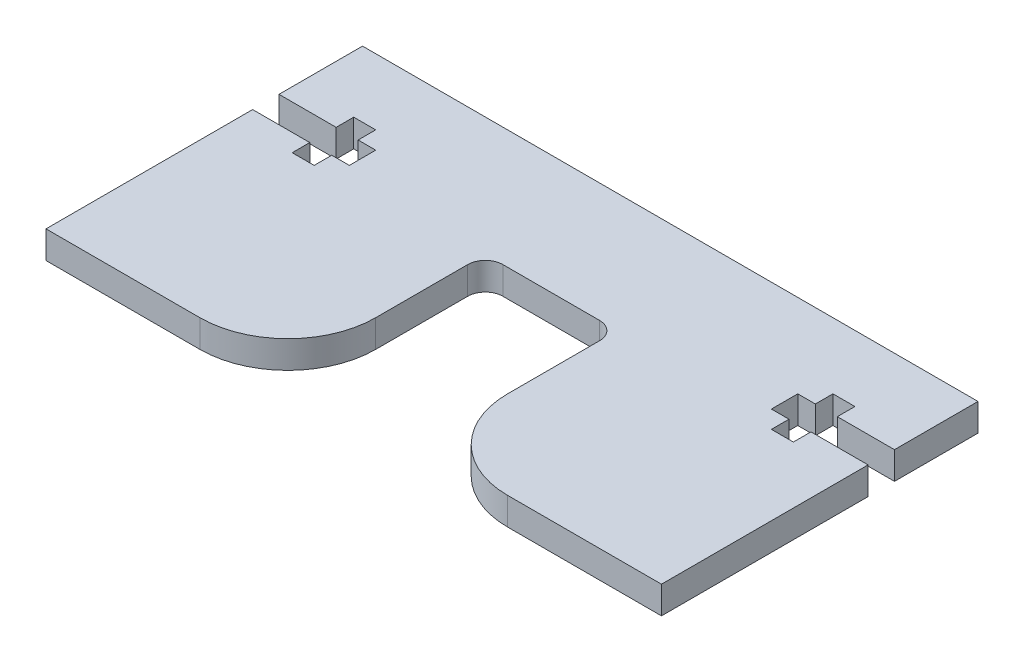
ISO-10303-21;
HEADER;
FILE_DESCRIPTION(('STEP AP214'),'2;1');
FILE_NAME('part.step','',(''),(''),'','','');
FILE_SCHEMA(('AUTOMOTIVE_DESIGN { 1 0 10303 214 1 1 1 1 }'));
ENDSEC;
DATA;
#1=APPLICATION_CONTEXT('core data for automotive mechanical design processes');
#2=APPLICATION_PROTOCOL_DEFINITION('international standard','automotive_design',2000,#1);
#3=PRODUCT_CONTEXT('',#1,'mechanical');
#4=PRODUCT('Part','Part','',(#3));
#5=PRODUCT_RELATED_PRODUCT_CATEGORY('part','',(#4));
#6=PRODUCT_DEFINITION_FORMATION('','',#4);
#7=PRODUCT_DEFINITION_CONTEXT('part definition',#1,'design');
#8=PRODUCT_DEFINITION('design','',#6,#7);
#9=PRODUCT_DEFINITION_SHAPE('','',#8);
#10=(LENGTH_UNIT() NAMED_UNIT(*) SI_UNIT(.MILLI.,.METRE.));
#11=(NAMED_UNIT(*) PLANE_ANGLE_UNIT() SI_UNIT($,.RADIAN.));
#12=(NAMED_UNIT(*) SI_UNIT($,.STERADIAN.) SOLID_ANGLE_UNIT());
#13=UNCERTAINTY_MEASURE_WITH_UNIT(LENGTH_MEASURE(1.E-05),#10,'distance_accuracy_value','');
#14=(GEOMETRIC_REPRESENTATION_CONTEXT(3) GLOBAL_UNCERTAINTY_ASSIGNED_CONTEXT((#13)) GLOBAL_UNIT_ASSIGNED_CONTEXT((#10,
#11,#12)) REPRESENTATION_CONTEXT('',''));
#15=CARTESIAN_POINT('',(0.,0.,0.));
#16=DIRECTION('',(0.,0.,1.));
#17=DIRECTION('',(1.,0.,0.));
#18=AXIS2_PLACEMENT_3D('',#15,#16,#17);
#19=CARTESIAN_POINT('',(0.,1.5625,0.));
#20=DIRECTION('',(0.,0.,-1.));
#21=DIRECTION('',(-1.,0.,0.));
#22=AXIS2_PLACEMENT_3D('',#19,#20,#21);
#23=PLANE('',#22);
#24=DIRECTION('',(1.,0.,0.));
#25=VECTOR('',#24,1.);
#26=CARTESIAN_POINT('',(0.,-1.5625,0.));
#27=LINE('',#26,#25);
#28=CARTESIAN_POINT('',(-35.,-1.5625,0.));
#29=VERTEX_POINT('',#28);
#30=CARTESIAN_POINT('',(-17.5,-1.5625,0.));
#31=VERTEX_POINT('',#30);
#32=EDGE_CURVE('E427',#29,#31,#27,.T.);
#33=ORIENTED_EDGE('',*,*,#32,.T.);
#34=DIRECTION('',(0.,-1.,0.));
#35=VECTOR('',#34,1.);
#36=CARTESIAN_POINT('',(-17.5,1.5625,0.));
#37=LINE('',#36,#35);
#38=CARTESIAN_POINT('',(-17.5,1.5625,0.));
#39=VERTEX_POINT('',#38);
#40=EDGE_CURVE('E505',#31,#39,#37,.F.);
#41=ORIENTED_EDGE('',*,*,#40,.T.);
#42=DIRECTION('',(1.,0.,0.));
#43=VECTOR('',#42,1.);
#44=CARTESIAN_POINT('',(0.,1.5625,0.));
#45=LINE('',#44,#43);
#46=CARTESIAN_POINT('',(-35.,1.5625,0.));
#47=VERTEX_POINT('',#46);
#48=EDGE_CURVE('E399',#47,#39,#45,.T.);
#49=ORIENTED_EDGE('',*,*,#48,.F.);
#50=DIRECTION('',(0.,-1.,0.));
#51=VECTOR('',#50,1.);
#52=CARTESIAN_POINT('',(-35.,1.5625,0.));
#53=LINE('',#52,#51);
#54=EDGE_CURVE('E338',#47,#29,#53,.T.);
#55=ORIENTED_EDGE('',*,*,#54,.T.);
#56=EDGE_LOOP('',(#33,#41,#49,#55));
#57=FACE_BOUND('',#56,.T.);
#58=ADVANCED_FACE('F34',(#57),#23,.F.);
#59=CARTESIAN_POINT('',(17.5,1.5625,0.));
#60=VERTEX_POINT('',#59);
#61=CARTESIAN_POINT('',(35.,1.5625,0.));
#62=VERTEX_POINT('',#61);
#63=EDGE_CURVE('E402',#60,#62,#45,.T.);
#64=ORIENTED_EDGE('',*,*,#63,.F.);
#65=DIRECTION('',(0.,-1.,0.));
#66=VECTOR('',#65,1.);
#67=CARTESIAN_POINT('',(17.5,1.5625,0.));
#68=LINE('',#67,#66);
#69=CARTESIAN_POINT('',(17.5,-1.5625,0.));
#70=VERTEX_POINT('',#69);
#71=EDGE_CURVE('E511',#60,#70,#68,.T.);
#72=ORIENTED_EDGE('',*,*,#71,.T.);
#73=CARTESIAN_POINT('',(35.,-1.5625,0.));
#74=VERTEX_POINT('',#73);
#75=EDGE_CURVE('E290',#70,#74,#27,.T.);
#76=ORIENTED_EDGE('',*,*,#75,.T.);
#77=DIRECTION('',(0.,-1.,0.));
#78=VECTOR('',#77,1.);
#79=CARTESIAN_POINT('',(35.,1.5625,0.));
#80=LINE('',#79,#78);
#81=EDGE_CURVE('E494',#62,#74,#80,.T.);
#82=ORIENTED_EDGE('',*,*,#81,.F.);
#83=EDGE_LOOP('',(#64,#72,#76,#82));
#84=FACE_BOUND('',#83,.T.);
#85=ADVANCED_FACE('F565',(#84),#23,.F.);
#86=CARTESIAN_POINT('',(35.,1.5625,-23.5));
#87=DIRECTION('',(-1.,0.,0.));
#88=DIRECTION('',(0.,0.,1.));
#89=AXIS2_PLACEMENT_3D('',#86,#87,#88);
#90=PLANE('',#89);
#91=DIRECTION('',(0.,0.,-1.));
#92=VECTOR('',#91,1.);
#93=CARTESIAN_POINT('',(35.,-1.5625,-23.5));
#94=LINE('',#93,#92);
#95=CARTESIAN_POINT('',(35.,-1.5625,-23.5));
#96=VERTEX_POINT('',#95);
#97=EDGE_CURVE('E430',#74,#96,#94,.T.);
#98=ORIENTED_EDGE('',*,*,#97,.T.);
#99=DIRECTION('',(0.,-1.,0.));
#100=VECTOR('',#99,1.);
#101=CARTESIAN_POINT('',(35.,1.5625,-23.5));
#102=LINE('',#101,#100);
#103=CARTESIAN_POINT('',(35.,1.5625,-23.5));
#104=VERTEX_POINT('',#103);
#105=EDGE_CURVE('E491',#104,#96,#102,.T.);
#106=ORIENTED_EDGE('',*,*,#105,.F.);
#107=DIRECTION('',(0.,0.,-1.));
#108=VECTOR('',#107,1.);
#109=CARTESIAN_POINT('',(35.,1.5625,-23.5));
#110=LINE('',#109,#108);
#111=EDGE_CURVE('E401',#62,#104,#110,.T.);
#112=ORIENTED_EDGE('',*,*,#111,.F.);
#113=ORIENTED_EDGE('',*,*,#81,.T.);
#114=EDGE_LOOP('',(#98,#106,#112,#113));
#115=FACE_BOUND('',#114,.T.);
#116=ADVANCED_FACE('F571',(#115),#90,.F.);
#117=CARTESIAN_POINT('',(28.5,1.5625,-23.5));
#118=DIRECTION('',(0.,0.,1.));
#119=DIRECTION('',(1.,0.,0.));
#120=AXIS2_PLACEMENT_3D('',#117,#118,#119);
#121=PLANE('',#120);
#122=DIRECTION('',(-1.,0.,0.));
#123=VECTOR('',#122,1.);
#124=CARTESIAN_POINT('',(28.5,-1.5625,-23.5));
#125=LINE('',#124,#123);
#126=CARTESIAN_POINT('',(28.5,-1.5625,-23.5));
#127=VERTEX_POINT('',#126);
#128=EDGE_CURVE('E432',#96,#127,#125,.T.);
#129=ORIENTED_EDGE('',*,*,#128,.T.);
#130=DIRECTION('',(0.,-1.,0.));
#131=VECTOR('',#130,1.);
#132=CARTESIAN_POINT('',(28.5,1.5625,-23.5));
#133=LINE('',#132,#131);
#134=CARTESIAN_POINT('',(28.5,1.5625,-23.5));
#135=VERTEX_POINT('',#134);
#136=EDGE_CURVE('E488',#135,#127,#133,.T.);
#137=ORIENTED_EDGE('',*,*,#136,.F.);
#138=DIRECTION('',(-1.,0.,0.));
#139=VECTOR('',#138,1.);
#140=CARTESIAN_POINT('',(28.5,1.5625,-23.5));
#141=LINE('',#140,#139);
#142=EDGE_CURVE('E404',#104,#135,#141,.T.);
#143=ORIENTED_EDGE('',*,*,#142,.F.);
#144=ORIENTED_EDGE('',*,*,#105,.T.);
#145=EDGE_LOOP('',(#129,#137,#143,#144));
#146=FACE_BOUND('',#145,.T.);
#147=ADVANCED_FACE('F597',(#146),#121,.F.);
#148=CARTESIAN_POINT('',(28.5,1.5625,-21.5));
#149=DIRECTION('',(1.,0.,0.));
#150=DIRECTION('',(0.,0.,-1.));
#151=AXIS2_PLACEMENT_3D('',#148,#149,#150);
#152=PLANE('',#151);
#153=DIRECTION('',(0.,0.,1.));
#154=VECTOR('',#153,1.);
#155=CARTESIAN_POINT('',(28.5,-1.5625,-21.5));
#156=LINE('',#155,#154);
#157=CARTESIAN_POINT('',(28.5,-1.5625,-21.5));
#158=VERTEX_POINT('',#157);
#159=EDGE_CURVE('E434',#127,#158,#156,.T.);
#160=ORIENTED_EDGE('',*,*,#159,.T.);
#161=DIRECTION('',(0.,-1.,0.));
#162=VECTOR('',#161,1.);
#163=CARTESIAN_POINT('',(28.5,1.5625,-21.5));
#164=LINE('',#163,#162);
#165=CARTESIAN_POINT('',(28.5,1.5625,-21.5));
#166=VERTEX_POINT('',#165);
#167=EDGE_CURVE('E485',#166,#158,#164,.T.);
#168=ORIENTED_EDGE('',*,*,#167,.F.);
#169=DIRECTION('',(0.,0.,1.));
#170=VECTOR('',#169,1.);
#171=CARTESIAN_POINT('',(28.5,1.5625,-21.5));
#172=LINE('',#171,#170);
#173=EDGE_CURVE('E406',#135,#166,#172,.T.);
#174=ORIENTED_EDGE('',*,*,#173,.F.);
#175=ORIENTED_EDGE('',*,*,#136,.T.);
#176=EDGE_LOOP('',(#160,#168,#174,#175));
#177=FACE_BOUND('',#176,.T.);
#178=ADVANCED_FACE('F601',(#177),#152,.F.);
#179=CARTESIAN_POINT('',(26.,1.5625,-21.5));
#180=DIRECTION('',(0.,0.,1.));
#181=DIRECTION('',(1.,0.,0.));
#182=AXIS2_PLACEMENT_3D('',#179,#180,#181);
#183=PLANE('',#182);
#184=DIRECTION('',(-1.,0.,0.));
#185=VECTOR('',#184,1.);
#186=CARTESIAN_POINT('',(26.,-1.5625,-21.5));
#187=LINE('',#186,#185);
#188=CARTESIAN_POINT('',(26.,-1.5625,-21.5));
#189=VERTEX_POINT('',#188);
#190=EDGE_CURVE('E436',#158,#189,#187,.T.);
#191=ORIENTED_EDGE('',*,*,#190,.T.);
#192=DIRECTION('',(0.,-1.,0.));
#193=VECTOR('',#192,1.);
#194=CARTESIAN_POINT('',(26.,1.5625,-21.5));
#195=LINE('',#194,#193);
#196=CARTESIAN_POINT('',(26.,1.5625,-21.5));
#197=VERTEX_POINT('',#196);
#198=EDGE_CURVE('E482',#197,#189,#195,.T.);
#199=ORIENTED_EDGE('',*,*,#198,.F.);
#200=DIRECTION('',(-1.,0.,0.));
#201=VECTOR('',#200,1.);
#202=CARTESIAN_POINT('',(26.,1.5625,-21.5));
#203=LINE('',#202,#201);
#204=EDGE_CURVE('E408',#166,#197,#203,.T.);
#205=ORIENTED_EDGE('',*,*,#204,.F.);
#206=ORIENTED_EDGE('',*,*,#167,.T.);
#207=EDGE_LOOP('',(#191,#199,#205,#206));
#208=FACE_BOUND('',#207,.T.);
#209=ADVANCED_FACE('F606',(#208),#183,.F.);
#210=CARTESIAN_POINT('',(26.,1.5625,-23.5));
#211=DIRECTION('',(-1.,0.,0.));
#212=DIRECTION('',(0.,0.,1.));
#213=AXIS2_PLACEMENT_3D('',#210,#211,#212);
#214=PLANE('',#213);
#215=DIRECTION('',(0.,0.,-1.));
#216=VECTOR('',#215,1.);
#217=CARTESIAN_POINT('',(26.,-1.5625,-23.5));
#218=LINE('',#217,#216);
#219=CARTESIAN_POINT('',(26.,-1.5625,-23.5));
#220=VERTEX_POINT('',#219);
#221=EDGE_CURVE('E438',#189,#220,#218,.T.);
#222=ORIENTED_EDGE('',*,*,#221,.T.);
#223=DIRECTION('',(0.,-1.,0.));
#224=VECTOR('',#223,1.);
#225=CARTESIAN_POINT('',(26.,1.5625,-23.5));
#226=LINE('',#225,#224);
#227=CARTESIAN_POINT('',(26.,1.5625,-23.5));
#228=VERTEX_POINT('',#227);
#229=EDGE_CURVE('E479',#228,#220,#226,.T.);
#230=ORIENTED_EDGE('',*,*,#229,.F.);
#231=DIRECTION('',(0.,0.,-1.));
#232=VECTOR('',#231,1.);
#233=CARTESIAN_POINT('',(26.,1.5625,-23.5));
#234=LINE('',#233,#232);
#235=EDGE_CURVE('E410',#197,#228,#234,.T.);
#236=ORIENTED_EDGE('',*,*,#235,.F.);
#237=ORIENTED_EDGE('',*,*,#198,.T.);
#238=EDGE_LOOP('',(#222,#230,#236,#237));
#239=FACE_BOUND('',#238,.T.);
#240=ADVANCED_FACE('F612',(#239),#214,.F.);
#241=CARTESIAN_POINT('',(24.,1.5625,-23.5));
#242=DIRECTION('',(0.,0.,1.));
#243=DIRECTION('',(1.,0.,0.));
#244=AXIS2_PLACEMENT_3D('',#241,#242,#243);
#245=PLANE('',#244);
#246=DIRECTION('',(-1.,0.,0.));
#247=VECTOR('',#246,1.);
#248=CARTESIAN_POINT('',(24.,-1.5625,-23.5));
#249=LINE('',#248,#247);
#250=CARTESIAN_POINT('',(24.,-1.5625,-23.5));
#251=VERTEX_POINT('',#250);
#252=EDGE_CURVE('E440',#220,#251,#249,.T.);
#253=ORIENTED_EDGE('',*,*,#252,.T.);
#254=DIRECTION('',(0.,-1.,0.));
#255=VECTOR('',#254,1.);
#256=CARTESIAN_POINT('',(24.,1.5625,-23.5));
#257=LINE('',#256,#255);
#258=CARTESIAN_POINT('',(24.,1.5625,-23.5));
#259=VERTEX_POINT('',#258);
#260=EDGE_CURVE('E476',#259,#251,#257,.T.);
#261=ORIENTED_EDGE('',*,*,#260,.F.);
#262=DIRECTION('',(-1.,0.,0.));
#263=VECTOR('',#262,1.);
#264=CARTESIAN_POINT('',(24.,1.5625,-23.5));
#265=LINE('',#264,#263);
#266=EDGE_CURVE('E412',#228,#259,#265,.T.);
#267=ORIENTED_EDGE('',*,*,#266,.F.);
#268=ORIENTED_EDGE('',*,*,#229,.T.);
#269=EDGE_LOOP('',(#253,#261,#267,#268));
#270=FACE_BOUND('',#269,.T.);
#271=ADVANCED_FACE('F616',(#270),#245,.F.);
#272=CARTESIAN_POINT('',(24.,1.5625,-26.5));
#273=DIRECTION('',(-1.,0.,0.));
#274=DIRECTION('',(0.,0.,1.));
#275=AXIS2_PLACEMENT_3D('',#272,#273,#274);
#276=PLANE('',#275);
#277=DIRECTION('',(0.,0.,-1.));
#278=VECTOR('',#277,1.);
#279=CARTESIAN_POINT('',(24.,-1.5625,-26.5));
#280=LINE('',#279,#278);
#281=CARTESIAN_POINT('',(24.,-1.5625,-26.5));
#282=VERTEX_POINT('',#281);
#283=EDGE_CURVE('E442',#251,#282,#280,.T.);
#284=ORIENTED_EDGE('',*,*,#283,.T.);
#285=DIRECTION('',(0.,-1.,0.));
#286=VECTOR('',#285,1.);
#287=CARTESIAN_POINT('',(24.,1.5625,-26.5));
#288=LINE('',#287,#286);
#289=CARTESIAN_POINT('',(24.,1.5625,-26.5));
#290=VERTEX_POINT('',#289);
#291=EDGE_CURVE('E473',#290,#282,#288,.T.);
#292=ORIENTED_EDGE('',*,*,#291,.F.);
#293=DIRECTION('',(0.,0.,-1.));
#294=VECTOR('',#293,1.);
#295=CARTESIAN_POINT('',(24.,1.5625,-26.5));
#296=LINE('',#295,#294);
#297=EDGE_CURVE('E414',#259,#290,#296,.T.);
#298=ORIENTED_EDGE('',*,*,#297,.F.);
#299=ORIENTED_EDGE('',*,*,#260,.T.);
#300=EDGE_LOOP('',(#284,#292,#298,#299));
#301=FACE_BOUND('',#300,.T.);
#302=ADVANCED_FACE('F621',(#301),#276,.F.);
#303=CARTESIAN_POINT('',(26.,1.5625,-26.5));
#304=DIRECTION('',(0.,0.,-1.));
#305=DIRECTION('',(-1.,0.,0.));
#306=AXIS2_PLACEMENT_3D('',#303,#304,#305);
#307=PLANE('',#306);
#308=DIRECTION('',(1.,0.,0.));
#309=VECTOR('',#308,1.);
#310=CARTESIAN_POINT('',(26.,-1.5625,-26.5));
#311=LINE('',#310,#309);
#312=CARTESIAN_POINT('',(26.,-1.5625,-26.5));
#313=VERTEX_POINT('',#312);
#314=EDGE_CURVE('E444',#282,#313,#311,.T.);
#315=ORIENTED_EDGE('',*,*,#314,.T.);
#316=DIRECTION('',(0.,-1.,0.));
#317=VECTOR('',#316,1.);
#318=CARTESIAN_POINT('',(26.,1.5625,-26.5));
#319=LINE('',#318,#317);
#320=CARTESIAN_POINT('',(26.,1.5625,-26.5));
#321=VERTEX_POINT('',#320);
#322=EDGE_CURVE('E470',#321,#313,#319,.T.);
#323=ORIENTED_EDGE('',*,*,#322,.F.);
#324=DIRECTION('',(1.,0.,0.));
#325=VECTOR('',#324,1.);
#326=CARTESIAN_POINT('',(26.,1.5625,-26.5));
#327=LINE('',#326,#325);
#328=EDGE_CURVE('E416',#290,#321,#327,.T.);
#329=ORIENTED_EDGE('',*,*,#328,.F.);
#330=ORIENTED_EDGE('',*,*,#291,.T.);
#331=EDGE_LOOP('',(#315,#323,#329,#330));
#332=FACE_BOUND('',#331,.T.);
#333=ADVANCED_FACE('F627',(#332),#307,.F.);
#334=CARTESIAN_POINT('',(26.,1.5625,-28.5));
#335=DIRECTION('',(-1.,0.,0.));
#336=DIRECTION('',(0.,0.,1.));
#337=AXIS2_PLACEMENT_3D('',#334,#335,#336);
#338=PLANE('',#337);
#339=DIRECTION('',(0.,0.,-1.));
#340=VECTOR('',#339,1.);
#341=CARTESIAN_POINT('',(26.,-1.5625,-28.5));
#342=LINE('',#341,#340);
#343=CARTESIAN_POINT('',(26.,-1.5625,-28.5));
#344=VERTEX_POINT('',#343);
#345=EDGE_CURVE('E446',#313,#344,#342,.T.);
#346=ORIENTED_EDGE('',*,*,#345,.T.);
#347=DIRECTION('',(0.,-1.,0.));
#348=VECTOR('',#347,1.);
#349=CARTESIAN_POINT('',(26.,1.5625,-28.5));
#350=LINE('',#349,#348);
#351=CARTESIAN_POINT('',(26.,1.5625,-28.5));
#352=VERTEX_POINT('',#351);
#353=EDGE_CURVE('E467',#352,#344,#350,.T.);
#354=ORIENTED_EDGE('',*,*,#353,.F.);
#355=DIRECTION('',(0.,0.,-1.));
#356=VECTOR('',#355,1.);
#357=CARTESIAN_POINT('',(26.,1.5625,-28.5));
#358=LINE('',#357,#356);
#359=EDGE_CURVE('E418',#321,#352,#358,.T.);
#360=ORIENTED_EDGE('',*,*,#359,.F.);
#361=ORIENTED_EDGE('',*,*,#322,.T.);
#362=EDGE_LOOP('',(#346,#354,#360,#361));
#363=FACE_BOUND('',#362,.T.);
#364=ADVANCED_FACE('F631',(#363),#338,.F.);
#365=CARTESIAN_POINT('',(28.5,1.5625,-28.5));
#366=DIRECTION('',(0.,0.,-1.));
#367=DIRECTION('',(-1.,0.,0.));
#368=AXIS2_PLACEMENT_3D('',#365,#366,#367);
#369=PLANE('',#368);
#370=DIRECTION('',(1.,0.,0.));
#371=VECTOR('',#370,1.);
#372=CARTESIAN_POINT('',(28.5,-1.5625,-28.5));
#373=LINE('',#372,#371);
#374=CARTESIAN_POINT('',(28.5,-1.5625,-28.5));
#375=VERTEX_POINT('',#374);
#376=EDGE_CURVE('E448',#344,#375,#373,.T.);
#377=ORIENTED_EDGE('',*,*,#376,.T.);
#378=DIRECTION('',(0.,-1.,0.));
#379=VECTOR('',#378,1.);
#380=CARTESIAN_POINT('',(28.5,1.5625,-28.5));
#381=LINE('',#380,#379);
#382=CARTESIAN_POINT('',(28.5,1.5625,-28.5));
#383=VERTEX_POINT('',#382);
#384=EDGE_CURVE('E464',#383,#375,#381,.T.);
#385=ORIENTED_EDGE('',*,*,#384,.F.);
#386=DIRECTION('',(1.,0.,0.));
#387=VECTOR('',#386,1.);
#388=CARTESIAN_POINT('',(28.5,1.5625,-28.5));
#389=LINE('',#388,#387);
#390=EDGE_CURVE('E420',#352,#383,#389,.T.);
#391=ORIENTED_EDGE('',*,*,#390,.F.);
#392=ORIENTED_EDGE('',*,*,#353,.T.);
#393=EDGE_LOOP('',(#377,#385,#391,#392));
#394=FACE_BOUND('',#393,.T.);
#395=ADVANCED_FACE('F636',(#394),#369,.F.);
#396=CARTESIAN_POINT('',(28.5,1.5625,-26.5));
#397=DIRECTION('',(1.,0.,0.));
#398=DIRECTION('',(0.,0.,-1.));
#399=AXIS2_PLACEMENT_3D('',#396,#397,#398);
#400=PLANE('',#399);
#401=DIRECTION('',(0.,0.,1.));
#402=VECTOR('',#401,1.);
#403=CARTESIAN_POINT('',(28.5,-1.5625,-26.5));
#404=LINE('',#403,#402);
#405=CARTESIAN_POINT('',(28.5,-1.5625,-26.5));
#406=VERTEX_POINT('',#405);
#407=EDGE_CURVE('E450',#375,#406,#404,.T.);
#408=ORIENTED_EDGE('',*,*,#407,.T.);
#409=DIRECTION('',(0.,-1.,0.));
#410=VECTOR('',#409,1.);
#411=CARTESIAN_POINT('',(28.5,1.5625,-26.5));
#412=LINE('',#411,#410);
#413=CARTESIAN_POINT('',(28.5,1.5625,-26.5));
#414=VERTEX_POINT('',#413);
#415=EDGE_CURVE('E461',#414,#406,#412,.T.);
#416=ORIENTED_EDGE('',*,*,#415,.F.);
#417=DIRECTION('',(0.,0.,1.));
#418=VECTOR('',#417,1.);
#419=CARTESIAN_POINT('',(28.5,1.5625,-26.5));
#420=LINE('',#419,#418);
#421=EDGE_CURVE('E422',#383,#414,#420,.T.);
#422=ORIENTED_EDGE('',*,*,#421,.F.);
#423=ORIENTED_EDGE('',*,*,#384,.T.);
#424=EDGE_LOOP('',(#408,#416,#422,#423));
#425=FACE_BOUND('',#424,.T.);
#426=ADVANCED_FACE('F642',(#425),#400,.F.);
#427=CARTESIAN_POINT('',(35.,1.5625,-26.5));
#428=DIRECTION('',(0.,0.,-1.));
#429=DIRECTION('',(-1.,0.,0.));
#430=AXIS2_PLACEMENT_3D('',#427,#428,#429);
#431=PLANE('',#430);
#432=DIRECTION('',(1.,0.,0.));
#433=VECTOR('',#432,1.);
#434=CARTESIAN_POINT('',(35.,-1.5625,-26.5));
#435=LINE('',#434,#433);
#436=CARTESIAN_POINT('',(35.,-1.5625,-26.5));
#437=VERTEX_POINT('',#436);
#438=EDGE_CURVE('E452',#406,#437,#435,.T.);
#439=ORIENTED_EDGE('',*,*,#438,.T.);
#440=DIRECTION('',(0.,-1.,0.));
#441=VECTOR('',#440,1.);
#442=CARTESIAN_POINT('',(35.,1.5625,-26.5));
#443=LINE('',#442,#441);
#444=CARTESIAN_POINT('',(35.,1.5625,-26.5));
#445=VERTEX_POINT('',#444);
#446=EDGE_CURVE('E458',#445,#437,#443,.T.);
#447=ORIENTED_EDGE('',*,*,#446,.F.);
#448=DIRECTION('',(1.,0.,0.));
#449=VECTOR('',#448,1.);
#450=CARTESIAN_POINT('',(35.,1.5625,-26.5));
#451=LINE('',#450,#449);
#452=EDGE_CURVE('E424',#414,#445,#451,.T.);
#453=ORIENTED_EDGE('',*,*,#452,.F.);
#454=ORIENTED_EDGE('',*,*,#415,.T.);
#455=EDGE_LOOP('',(#439,#447,#453,#454));
#456=FACE_BOUND('',#455,.T.);
#457=ADVANCED_FACE('F646',(#456),#431,.F.);
#458=CARTESIAN_POINT('',(35.,1.5625,-36.));
#459=DIRECTION('',(-1.,0.,0.));
#460=DIRECTION('',(0.,0.,1.));
#461=AXIS2_PLACEMENT_3D('',#458,#459,#460);
#462=PLANE('',#461);
#463=DIRECTION('',(0.,0.,-1.));
#464=VECTOR('',#463,1.);
#465=CARTESIAN_POINT('',(35.,-1.5625,-36.));
#466=LINE('',#465,#464);
#467=CARTESIAN_POINT('',(35.,-1.5625,-36.));
#468=VERTEX_POINT('',#467);
#469=EDGE_CURVE('E454',#437,#468,#466,.T.);
#470=ORIENTED_EDGE('',*,*,#469,.T.);
#471=DIRECTION('',(0.,-1.,0.));
#472=VECTOR('',#471,1.);
#473=CARTESIAN_POINT('',(35.,1.5625,-36.));
#474=LINE('',#473,#472);
#475=CARTESIAN_POINT('',(35.,1.5625,-36.));
#476=VERTEX_POINT('',#475);
#477=EDGE_CURVE('E280',#476,#468,#474,.T.);
#478=ORIENTED_EDGE('',*,*,#477,.F.);
#479=DIRECTION('',(0.,0.,-1.));
#480=VECTOR('',#479,1.);
#481=CARTESIAN_POINT('',(35.,1.5625,-36.));
#482=LINE('',#481,#480);
#483=EDGE_CURVE('E276',#445,#476,#482,.T.);
#484=ORIENTED_EDGE('',*,*,#483,.F.);
#485=ORIENTED_EDGE('',*,*,#446,.T.);
#486=EDGE_LOOP('',(#470,#478,#484,#485));
#487=FACE_BOUND('',#486,.T.);
#488=ADVANCED_FACE('F649',(#487),#462,.F.);
#489=CARTESIAN_POINT('',(0.,1.5625,-36.));
#490=DIRECTION('',(0.,0.,1.));
#491=DIRECTION('',(1.,0.,0.));
#492=AXIS2_PLACEMENT_3D('',#489,#490,#491);
#493=PLANE('',#492);
#494=DIRECTION('',(-1.,0.,0.));
#495=VECTOR('',#494,1.);
#496=CARTESIAN_POINT('',(0.,-1.5625,-36.));
#497=LINE('',#496,#495);
#498=CARTESIAN_POINT('',(-35.,-1.5625,-36.));
#499=VERTEX_POINT('',#498);
#500=EDGE_CURVE('E286',#468,#499,#497,.T.);
#501=ORIENTED_EDGE('',*,*,#500,.T.);
#502=DIRECTION('',(0.,-1.,0.));
#503=VECTOR('',#502,1.);
#504=CARTESIAN_POINT('',(-35.,1.5625,-36.));
#505=LINE('',#504,#503);
#506=CARTESIAN_POINT('',(-35.,1.5625,-36.));
#507=VERTEX_POINT('',#506);
#508=EDGE_CURVE('E283',#507,#499,#505,.T.);
#509=ORIENTED_EDGE('',*,*,#508,.F.);
#510=DIRECTION('',(-1.,0.,0.));
#511=VECTOR('',#510,1.);
#512=CARTESIAN_POINT('',(0.,1.5625,-36.));
#513=LINE('',#512,#511);
#514=EDGE_CURVE('E267',#476,#507,#513,.T.);
#515=ORIENTED_EDGE('',*,*,#514,.F.);
#516=ORIENTED_EDGE('',*,*,#477,.T.);
#517=EDGE_LOOP('',(#501,#509,#515,#516));
#518=FACE_BOUND('',#517,.T.);
#519=ADVANCED_FACE('F284',(#518),#493,.F.);
#520=CARTESIAN_POINT('',(0.,1.5625,0.));
#521=DIRECTION('',(0.,1.,0.));
#522=DIRECTION('',(0.,0.,1.));
#523=AXIS2_PLACEMENT_3D('',#520,#521,#522);
#524=PLANE('',#523);
#525=ORIENTED_EDGE('',*,*,#48,.T.);
#526=CARTESIAN_POINT('',(-17.5,1.5625,-10.));
#527=DIRECTION('',(0.,1.,0.));
#528=DIRECTION('',(0.,0.,1.));
#529=AXIS2_PLACEMENT_3D('',#526,#527,#528);
#530=CIRCLE('',#529,10.);
#531=CARTESIAN_POINT('',(-7.5,1.5625,-10.));
#532=VERTEX_POINT('',#531);
#533=EDGE_CURVE('E509',#39,#532,#530,.T.);
#534=ORIENTED_EDGE('',*,*,#533,.T.);
#535=DIRECTION('',(0.,0.,-1.));
#536=VECTOR('',#535,1.);
#537=CARTESIAN_POINT('',(-7.5,1.5625,0.));
#538=LINE('',#537,#536);
#539=CARTESIAN_POINT('',(-7.5,1.5625,-20.4625000000001));
#540=VERTEX_POINT('',#539);
#541=EDGE_CURVE('E551',#532,#540,#538,.T.);
#542=ORIENTED_EDGE('',*,*,#541,.T.);
#543=CARTESIAN_POINT('',(-5.5,1.5625,-20.4625000000001));
#544=DIRECTION('',(0.,1.,0.));
#545=DIRECTION('',(0.,0.,1.));
#546=AXIS2_PLACEMENT_3D('',#543,#544,#545);
#547=CIRCLE('',#546,2.);
#548=CARTESIAN_POINT('',(-5.5,1.5625,-22.4625000000001));
#549=VERTEX_POINT('',#548);
#550=EDGE_CURVE('E11',#540,#549,#547,.F.);
#551=ORIENTED_EDGE('',*,*,#550,.T.);
#552=DIRECTION('',(1.,0.,0.));
#553=VECTOR('',#552,1.);
#554=CARTESIAN_POINT('',(-7.5,1.5625,-22.4625000000001));
#555=LINE('',#554,#553);
#556=CARTESIAN_POINT('',(5.5,1.5625,-22.4625000000001));
#557=VERTEX_POINT('',#556);
#558=EDGE_CURVE('E533',#549,#557,#555,.T.);
#559=ORIENTED_EDGE('',*,*,#558,.T.);
#560=CARTESIAN_POINT('',(5.5,1.5625,-20.4625000000001));
#561=DIRECTION('',(0.,1.,0.));
#562=DIRECTION('',(0.,0.,1.));
#563=AXIS2_PLACEMENT_3D('',#560,#561,#562);
#564=CIRCLE('',#563,2.);
#565=CARTESIAN_POINT('',(7.5,1.5625,-20.4625000000001));
#566=VERTEX_POINT('',#565);
#567=EDGE_CURVE('E528',#557,#566,#564,.F.);
#568=ORIENTED_EDGE('',*,*,#567,.T.);
#569=DIRECTION('',(0.,0.,1.));
#570=VECTOR('',#569,1.);
#571=CARTESIAN_POINT('',(7.5,1.5625,0.));
#572=LINE('',#571,#570);
#573=CARTESIAN_POINT('',(7.5,1.5625,-10.));
#574=VERTEX_POINT('',#573);
#575=EDGE_CURVE('E342',#566,#574,#572,.T.);
#576=ORIENTED_EDGE('',*,*,#575,.T.);
#577=CARTESIAN_POINT('',(17.5,1.5625,-10.));
#578=DIRECTION('',(0.,1.,0.));
#579=DIRECTION('',(0.,0.,1.));
#580=AXIS2_PLACEMENT_3D('',#577,#578,#579);
#581=CIRCLE('',#580,10.);
#582=EDGE_CURVE('E507',#574,#60,#581,.T.);
#583=ORIENTED_EDGE('',*,*,#582,.T.);
#584=ORIENTED_EDGE('',*,*,#63,.T.);
#585=ORIENTED_EDGE('',*,*,#111,.T.);
#586=ORIENTED_EDGE('',*,*,#142,.T.);
#587=ORIENTED_EDGE('',*,*,#173,.T.);
#588=ORIENTED_EDGE('',*,*,#204,.T.);
#589=ORIENTED_EDGE('',*,*,#235,.T.);
#590=ORIENTED_EDGE('',*,*,#266,.T.);
#591=ORIENTED_EDGE('',*,*,#297,.T.);
#592=ORIENTED_EDGE('',*,*,#328,.T.);
#593=ORIENTED_EDGE('',*,*,#359,.T.);
#594=ORIENTED_EDGE('',*,*,#390,.T.);
#595=ORIENTED_EDGE('',*,*,#421,.T.);
#596=ORIENTED_EDGE('',*,*,#452,.T.);
#597=ORIENTED_EDGE('',*,*,#483,.T.);
#598=ORIENTED_EDGE('',*,*,#514,.T.);
#599=DIRECTION('',(0.,0.,-1.));
#600=VECTOR('',#599,1.);
#601=CARTESIAN_POINT('',(-35.,1.5625,-36.));
#602=LINE('',#601,#600);
#603=CARTESIAN_POINT('',(-35.,1.5625,-26.5));
#604=VERTEX_POINT('',#603);
#605=EDGE_CURVE('E273',#604,#507,#602,.T.);
#606=ORIENTED_EDGE('',*,*,#605,.F.);
#607=DIRECTION('',(-1.,0.,0.));
#608=VECTOR('',#607,1.);
#609=CARTESIAN_POINT('',(-35.,1.5625,-26.5));
#610=LINE('',#609,#608);
#611=CARTESIAN_POINT('',(-28.5,1.5625,-26.5));
#612=VERTEX_POINT('',#611);
#613=EDGE_CURVE('E294',#612,#604,#610,.T.);
#614=ORIENTED_EDGE('',*,*,#613,.F.);
#615=DIRECTION('',(0.,0.,1.));
#616=VECTOR('',#615,1.);
#617=CARTESIAN_POINT('',(-28.5,1.5625,-26.5));
#618=LINE('',#617,#616);
#619=CARTESIAN_POINT('',(-28.5,1.5625,-28.5));
#620=VERTEX_POINT('',#619);
#621=EDGE_CURVE('E297',#620,#612,#618,.T.);
#622=ORIENTED_EDGE('',*,*,#621,.F.);
#623=DIRECTION('',(-1.,0.,0.));
#624=VECTOR('',#623,1.);
#625=CARTESIAN_POINT('',(-28.5,1.5625,-28.5));
#626=LINE('',#625,#624);
#627=CARTESIAN_POINT('',(-26.,1.5625,-28.5));
#628=VERTEX_POINT('',#627);
#629=EDGE_CURVE('E308',#628,#620,#626,.T.);
#630=ORIENTED_EDGE('',*,*,#629,.F.);
#631=DIRECTION('',(0.,0.,-1.));
#632=VECTOR('',#631,1.);
#633=CARTESIAN_POINT('',(-26.,1.5625,-28.5));
#634=LINE('',#633,#632);
#635=CARTESIAN_POINT('',(-26.,1.5625,-26.5));
#636=VERTEX_POINT('',#635);
#637=EDGE_CURVE('E311',#636,#628,#634,.T.);
#638=ORIENTED_EDGE('',*,*,#637,.F.);
#639=DIRECTION('',(-1.,0.,0.));
#640=VECTOR('',#639,1.);
#641=CARTESIAN_POINT('',(-26.,1.5625,-26.5));
#642=LINE('',#641,#640);
#643=CARTESIAN_POINT('',(-24.,1.5625,-26.5));
#644=VERTEX_POINT('',#643);
#645=EDGE_CURVE('E314',#644,#636,#642,.T.);
#646=ORIENTED_EDGE('',*,*,#645,.F.);
#647=DIRECTION('',(0.,0.,-1.));
#648=VECTOR('',#647,1.);
#649=CARTESIAN_POINT('',(-24.,1.5625,-26.5));
#650=LINE('',#649,#648);
#651=CARTESIAN_POINT('',(-24.,1.5625,-23.5));
#652=VERTEX_POINT('',#651);
#653=EDGE_CURVE('E317',#652,#644,#650,.T.);
#654=ORIENTED_EDGE('',*,*,#653,.F.);
#655=DIRECTION('',(1.,0.,0.));
#656=VECTOR('',#655,1.);
#657=CARTESIAN_POINT('',(-24.,1.5625,-23.5));
#658=LINE('',#657,#656);
#659=CARTESIAN_POINT('',(-26.,1.5625,-23.5));
#660=VERTEX_POINT('',#659);
#661=EDGE_CURVE('E320',#660,#652,#658,.T.);
#662=ORIENTED_EDGE('',*,*,#661,.F.);
#663=DIRECTION('',(0.,0.,-1.));
#664=VECTOR('',#663,1.);
#665=CARTESIAN_POINT('',(-26.,1.5625,-23.5));
#666=LINE('',#665,#664);
#667=CARTESIAN_POINT('',(-26.,1.5625,-21.5));
#668=VERTEX_POINT('',#667);
#669=EDGE_CURVE('E323',#668,#660,#666,.T.);
#670=ORIENTED_EDGE('',*,*,#669,.F.);
#671=DIRECTION('',(1.,0.,0.));
#672=VECTOR('',#671,1.);
#673=CARTESIAN_POINT('',(-26.,1.5625,-21.5));
#674=LINE('',#673,#672);
#675=CARTESIAN_POINT('',(-28.5,1.5625,-21.5));
#676=VERTEX_POINT('',#675);
#677=EDGE_CURVE('E326',#676,#668,#674,.T.);
#678=ORIENTED_EDGE('',*,*,#677,.F.);
#679=DIRECTION('',(0.,0.,1.));
#680=VECTOR('',#679,1.);
#681=CARTESIAN_POINT('',(-28.5,1.5625,-21.5));
#682=LINE('',#681,#680);
#683=CARTESIAN_POINT('',(-28.5,1.5625,-23.5));
#684=VERTEX_POINT('',#683);
#685=EDGE_CURVE('E329',#684,#676,#682,.T.);
#686=ORIENTED_EDGE('',*,*,#685,.F.);
#687=DIRECTION('',(1.,0.,0.));
#688=VECTOR('',#687,1.);
#689=CARTESIAN_POINT('',(-28.5,1.5625,-23.5));
#690=LINE('',#689,#688);
#691=CARTESIAN_POINT('',(-35.,1.5625,-23.5));
#692=VERTEX_POINT('',#691);
#693=EDGE_CURVE('E332',#692,#684,#690,.T.);
#694=ORIENTED_EDGE('',*,*,#693,.F.);
#695=DIRECTION('',(0.,0.,-1.));
#696=VECTOR('',#695,1.);
#697=CARTESIAN_POINT('',(-35.,1.5625,-23.5));
#698=LINE('',#697,#696);
#699=EDGE_CURVE('E335',#47,#692,#698,.T.);
#700=ORIENTED_EDGE('',*,*,#699,.F.);
#701=EDGE_LOOP('',(#525,#534,#542,#551,#559,#568,#576,#583,#584,#585,#586,#587,#588,#589,#590,
#591,#592,#593,#594,#595,#596,#597,#598,#606,#614,#622,#630,#638,#646,#654,#662,#670,#678,#686,
#694,#700));
#702=FACE_BOUND('',#701,.T.);
#703=ADVANCED_FACE('F270',(#702),#524,.T.);
#704=CARTESIAN_POINT('',(0.,-1.5625,0.));
#705=DIRECTION('',(0.,1.,0.));
#706=DIRECTION('',(0.,0.,1.));
#707=AXIS2_PLACEMENT_3D('',#704,#705,#706);
#708=PLANE('',#707);
#709=DIRECTION('',(0.,0.,-1.));
#710=VECTOR('',#709,1.);
#711=CARTESIAN_POINT('',(-7.5,-1.5625,0.));
#712=LINE('',#711,#710);
#713=CARTESIAN_POINT('',(-7.5,-1.5625,-10.));
#714=VERTEX_POINT('',#713);
#715=CARTESIAN_POINT('',(-7.5,-1.5625,-20.4625000000001));
#716=VERTEX_POINT('',#715);
#717=EDGE_CURVE('E550',#714,#716,#712,.T.);
#718=ORIENTED_EDGE('',*,*,#717,.F.);
#719=CARTESIAN_POINT('',(-17.5,-1.5625,-10.));
#720=DIRECTION('',(0.,1.,0.));
#721=DIRECTION('',(0.,0.,1.));
#722=AXIS2_PLACEMENT_3D('',#719,#720,#721);
#723=CIRCLE('',#722,10.);
#724=EDGE_CURVE('E503',#714,#31,#723,.F.);
#725=ORIENTED_EDGE('',*,*,#724,.T.);
#726=ORIENTED_EDGE('',*,*,#32,.F.);
#727=DIRECTION('',(0.,0.,-1.));
#728=VECTOR('',#727,1.);
#729=CARTESIAN_POINT('',(-35.,-1.5625,-23.5));
#730=LINE('',#729,#728);
#731=CARTESIAN_POINT('',(-35.,-1.5625,-23.5));
#732=VERTEX_POINT('',#731);
#733=EDGE_CURVE('E295',#29,#732,#730,.T.);
#734=ORIENTED_EDGE('',*,*,#733,.T.);
#735=DIRECTION('',(1.,0.,0.));
#736=VECTOR('',#735,1.);
#737=CARTESIAN_POINT('',(-28.5,-1.5625,-23.5));
#738=LINE('',#737,#736);
#739=CARTESIAN_POINT('',(-28.5,-1.5625,-23.5));
#740=VERTEX_POINT('',#739);
#741=EDGE_CURVE('E300',#732,#740,#738,.T.);
#742=ORIENTED_EDGE('',*,*,#741,.T.);
#743=DIRECTION('',(0.,0.,1.));
#744=VECTOR('',#743,1.);
#745=CARTESIAN_POINT('',(-28.5,-1.5625,-21.5));
#746=LINE('',#745,#744);
#747=CARTESIAN_POINT('',(-28.5,-1.5625,-21.5));
#748=VERTEX_POINT('',#747);
#749=EDGE_CURVE('E369',#740,#748,#746,.T.);
#750=ORIENTED_EDGE('',*,*,#749,.T.);
#751=DIRECTION('',(1.,0.,0.));
#752=VECTOR('',#751,1.);
#753=CARTESIAN_POINT('',(-26.,-1.5625,-21.5));
#754=LINE('',#753,#752);
#755=CARTESIAN_POINT('',(-26.,-1.5625,-21.5));
#756=VERTEX_POINT('',#755);
#757=EDGE_CURVE('E366',#748,#756,#754,.T.);
#758=ORIENTED_EDGE('',*,*,#757,.T.);
#759=DIRECTION('',(0.,0.,-1.));
#760=VECTOR('',#759,1.);
#761=CARTESIAN_POINT('',(-26.,-1.5625,-23.5));
#762=LINE('',#761,#760);
#763=CARTESIAN_POINT('',(-26.,-1.5625,-23.5));
#764=VERTEX_POINT('',#763);
#765=EDGE_CURVE('E363',#756,#764,#762,.T.);
#766=ORIENTED_EDGE('',*,*,#765,.T.);
#767=DIRECTION('',(1.,0.,0.));
#768=VECTOR('',#767,1.);
#769=CARTESIAN_POINT('',(-24.,-1.5625,-23.5));
#770=LINE('',#769,#768);
#771=CARTESIAN_POINT('',(-24.,-1.5625,-23.5));
#772=VERTEX_POINT('',#771);
#773=EDGE_CURVE('E360',#764,#772,#770,.T.);
#774=ORIENTED_EDGE('',*,*,#773,.T.);
#775=DIRECTION('',(0.,0.,-1.));
#776=VECTOR('',#775,1.);
#777=CARTESIAN_POINT('',(-24.,-1.5625,-26.5));
#778=LINE('',#777,#776);
#779=CARTESIAN_POINT('',(-24.,-1.5625,-26.5));
#780=VERTEX_POINT('',#779);
#781=EDGE_CURVE('E357',#772,#780,#778,.T.);
#782=ORIENTED_EDGE('',*,*,#781,.T.);
#783=DIRECTION('',(-1.,0.,0.));
#784=VECTOR('',#783,1.);
#785=CARTESIAN_POINT('',(-26.,-1.5625,-26.5));
#786=LINE('',#785,#784);
#787=CARTESIAN_POINT('',(-26.,-1.5625,-26.5));
#788=VERTEX_POINT('',#787);
#789=EDGE_CURVE('E354',#780,#788,#786,.T.);
#790=ORIENTED_EDGE('',*,*,#789,.T.);
#791=DIRECTION('',(0.,0.,-1.));
#792=VECTOR('',#791,1.);
#793=CARTESIAN_POINT('',(-26.,-1.5625,-28.5));
#794=LINE('',#793,#792);
#795=CARTESIAN_POINT('',(-26.,-1.5625,-28.5));
#796=VERTEX_POINT('',#795);
#797=EDGE_CURVE('E351',#788,#796,#794,.T.);
#798=ORIENTED_EDGE('',*,*,#797,.T.);
#799=DIRECTION('',(-1.,0.,0.));
#800=VECTOR('',#799,1.);
#801=CARTESIAN_POINT('',(-28.5,-1.5625,-28.5));
#802=LINE('',#801,#800);
#803=CARTESIAN_POINT('',(-28.5,-1.5625,-28.5));
#804=VERTEX_POINT('',#803);
#805=EDGE_CURVE('E348',#796,#804,#802,.T.);
#806=ORIENTED_EDGE('',*,*,#805,.T.);
#807=DIRECTION('',(0.,0.,1.));
#808=VECTOR('',#807,1.);
#809=CARTESIAN_POINT('',(-28.5,-1.5625,-26.5));
#810=LINE('',#809,#808);
#811=CARTESIAN_POINT('',(-28.5,-1.5625,-26.5));
#812=VERTEX_POINT('',#811);
#813=EDGE_CURVE('E345',#804,#812,#810,.T.);
#814=ORIENTED_EDGE('',*,*,#813,.T.);
#815=DIRECTION('',(-1.,0.,0.));
#816=VECTOR('',#815,1.);
#817=CARTESIAN_POINT('',(-35.,-1.5625,-26.5));
#818=LINE('',#817,#816);
#819=CARTESIAN_POINT('',(-35.,-1.5625,-26.5));
#820=VERTEX_POINT('',#819);
#821=EDGE_CURVE('E341',#812,#820,#818,.T.);
#822=ORIENTED_EDGE('',*,*,#821,.T.);
#823=DIRECTION('',(0.,0.,-1.));
#824=VECTOR('',#823,1.);
#825=CARTESIAN_POINT('',(-35.,-1.5625,-36.));
#826=LINE('',#825,#824);
#827=EDGE_CURVE('E339',#820,#499,#826,.T.);
#828=ORIENTED_EDGE('',*,*,#827,.T.);
#829=ORIENTED_EDGE('',*,*,#500,.F.);
#830=ORIENTED_EDGE('',*,*,#469,.F.);
#831=ORIENTED_EDGE('',*,*,#438,.F.);
#832=ORIENTED_EDGE('',*,*,#407,.F.);
#833=ORIENTED_EDGE('',*,*,#376,.F.);
#834=ORIENTED_EDGE('',*,*,#345,.F.);
#835=ORIENTED_EDGE('',*,*,#314,.F.);
#836=ORIENTED_EDGE('',*,*,#283,.F.);
#837=ORIENTED_EDGE('',*,*,#252,.F.);
#838=ORIENTED_EDGE('',*,*,#221,.F.);
#839=ORIENTED_EDGE('',*,*,#190,.F.);
#840=ORIENTED_EDGE('',*,*,#159,.F.);
#841=ORIENTED_EDGE('',*,*,#128,.F.);
#842=ORIENTED_EDGE('',*,*,#97,.F.);
#843=ORIENTED_EDGE('',*,*,#75,.F.);
#844=CARTESIAN_POINT('',(17.5,-1.5625,-10.));
#845=DIRECTION('',(0.,1.,0.));
#846=DIRECTION('',(0.,0.,1.));
#847=AXIS2_PLACEMENT_3D('',#844,#845,#846);
#848=CIRCLE('',#847,10.);
#849=CARTESIAN_POINT('',(7.5,-1.5625,-10.));
#850=VERTEX_POINT('',#849);
#851=EDGE_CURVE('E500',#70,#850,#848,.F.);
#852=ORIENTED_EDGE('',*,*,#851,.T.);
#853=DIRECTION('',(0.,0.,1.));
#854=VECTOR('',#853,1.);
#855=CARTESIAN_POINT('',(7.5,-1.5625,0.));
#856=LINE('',#855,#854);
#857=CARTESIAN_POINT('',(7.5,-1.5625,-20.4625000000001));
#858=VERTEX_POINT('',#857);
#859=EDGE_CURVE('E303',#858,#850,#856,.T.);
#860=ORIENTED_EDGE('',*,*,#859,.F.);
#861=CARTESIAN_POINT('',(5.5,-1.5625,-20.4625000000001));
#862=DIRECTION('',(0.,1.,0.));
#863=DIRECTION('',(0.,0.,1.));
#864=AXIS2_PLACEMENT_3D('',#861,#862,#863);
#865=CIRCLE('',#864,2.);
#866=CARTESIAN_POINT('',(5.5,-1.5625,-22.4625000000001));
#867=VERTEX_POINT('',#866);
#868=EDGE_CURVE('E526',#858,#867,#865,.T.);
#869=ORIENTED_EDGE('',*,*,#868,.T.);
#870=DIRECTION('',(1.,0.,0.));
#871=VECTOR('',#870,1.);
#872=CARTESIAN_POINT('',(-7.5,-1.5625,-22.4625000000001));
#873=LINE('',#872,#871);
#874=CARTESIAN_POINT('',(-5.5,-1.5625,-22.4625000000001));
#875=VERTEX_POINT('',#874);
#876=EDGE_CURVE('E546',#875,#867,#873,.T.);
#877=ORIENTED_EDGE('',*,*,#876,.F.);
#878=CARTESIAN_POINT('',(-5.5,-1.5625,-20.4625000000001));
#879=DIRECTION('',(0.,1.,0.));
#880=DIRECTION('',(0.,0.,1.));
#881=AXIS2_PLACEMENT_3D('',#878,#879,#880);
#882=CIRCLE('',#881,2.);
#883=EDGE_CURVE('E42',#875,#716,#882,.T.);
#884=ORIENTED_EDGE('',*,*,#883,.T.);
#885=EDGE_LOOP('',(#718,#725,#726,#734,#742,#750,#758,#766,#774,#782,#790,#798,#806,#814,#822,
#828,#829,#830,#831,#832,#833,#834,#835,#836,#837,#838,#839,#840,#841,#842,#843,#852,#860,#869,
#877,#884));
#886=FACE_BOUND('',#885,.T.);
#887=ADVANCED_FACE('F545',(#886),#708,.F.);
#888=CARTESIAN_POINT('',(-35.,1.5625,-36.));
#889=DIRECTION('',(-1.,0.,0.));
#890=DIRECTION('',(0.,0.,1.));
#891=AXIS2_PLACEMENT_3D('',#888,#889,#890);
#892=PLANE('',#891);
#893=ORIENTED_EDGE('',*,*,#827,.F.);
#894=DIRECTION('',(0.,-1.,0.));
#895=VECTOR('',#894,1.);
#896=CARTESIAN_POINT('',(-35.,1.5625,-26.5));
#897=LINE('',#896,#895);
#898=EDGE_CURVE('E291',#604,#820,#897,.T.);
#899=ORIENTED_EDGE('',*,*,#898,.F.);
#900=ORIENTED_EDGE('',*,*,#605,.T.);
#901=ORIENTED_EDGE('',*,*,#508,.T.);
#902=EDGE_LOOP('',(#893,#899,#900,#901));
#903=FACE_BOUND('',#902,.T.);
#904=ADVANCED_FACE('F293',(#903),#892,.T.);
#905=CARTESIAN_POINT('',(-35.,1.5625,-26.5));
#906=DIRECTION('',(0.,0.,1.));
#907=DIRECTION('',(1.,0.,0.));
#908=AXIS2_PLACEMENT_3D('',#905,#906,#907);
#909=PLANE('',#908);
#910=ORIENTED_EDGE('',*,*,#821,.F.);
#911=DIRECTION('',(0.,-1.,0.));
#912=VECTOR('',#911,1.);
#913=CARTESIAN_POINT('',(-28.5,1.5625,-26.5));
#914=LINE('',#913,#912);
#915=EDGE_CURVE('E396',#612,#812,#914,.T.);
#916=ORIENTED_EDGE('',*,*,#915,.F.);
#917=ORIENTED_EDGE('',*,*,#613,.T.);
#918=ORIENTED_EDGE('',*,*,#898,.T.);
#919=EDGE_LOOP('',(#910,#916,#917,#918));
#920=FACE_BOUND('',#919,.T.);
#921=ADVANCED_FACE('F653',(#920),#909,.T.);
#922=CARTESIAN_POINT('',(-28.5,1.5625,-26.5));
#923=DIRECTION('',(1.,0.,0.));
#924=DIRECTION('',(0.,0.,-1.));
#925=AXIS2_PLACEMENT_3D('',#922,#923,#924);
#926=PLANE('',#925);
#927=ORIENTED_EDGE('',*,*,#813,.F.);
#928=DIRECTION('',(0.,-1.,0.));
#929=VECTOR('',#928,1.);
#930=CARTESIAN_POINT('',(-28.5,1.5625,-28.5));
#931=LINE('',#930,#929);
#932=EDGE_CURVE('E394',#620,#804,#931,.T.);
#933=ORIENTED_EDGE('',*,*,#932,.F.);
#934=ORIENTED_EDGE('',*,*,#621,.T.);
#935=ORIENTED_EDGE('',*,*,#915,.T.);
#936=EDGE_LOOP('',(#927,#933,#934,#935));
#937=FACE_BOUND('',#936,.T.);
#938=ADVANCED_FACE('F657',(#937),#926,.T.);
#939=CARTESIAN_POINT('',(-28.5,1.5625,-28.5));
#940=DIRECTION('',(0.,0.,1.));
#941=DIRECTION('',(1.,0.,0.));
#942=AXIS2_PLACEMENT_3D('',#939,#940,#941);
#943=PLANE('',#942);
#944=ORIENTED_EDGE('',*,*,#805,.F.);
#945=DIRECTION('',(0.,-1.,0.));
#946=VECTOR('',#945,1.);
#947=CARTESIAN_POINT('',(-26.,1.5625,-28.5));
#948=LINE('',#947,#946);
#949=EDGE_CURVE('E392',#628,#796,#948,.T.);
#950=ORIENTED_EDGE('',*,*,#949,.F.);
#951=ORIENTED_EDGE('',*,*,#629,.T.);
#952=ORIENTED_EDGE('',*,*,#932,.T.);
#953=EDGE_LOOP('',(#944,#950,#951,#952));
#954=FACE_BOUND('',#953,.T.);
#955=ADVANCED_FACE('F660',(#954),#943,.T.);
#956=CARTESIAN_POINT('',(-26.,1.5625,-28.5));
#957=DIRECTION('',(-1.,0.,0.));
#958=DIRECTION('',(0.,0.,1.));
#959=AXIS2_PLACEMENT_3D('',#956,#957,#958);
#960=PLANE('',#959);
#961=ORIENTED_EDGE('',*,*,#797,.F.);
#962=DIRECTION('',(0.,-1.,0.));
#963=VECTOR('',#962,1.);
#964=CARTESIAN_POINT('',(-26.,1.5625,-26.5));
#965=LINE('',#964,#963);
#966=EDGE_CURVE('E390',#636,#788,#965,.T.);
#967=ORIENTED_EDGE('',*,*,#966,.F.);
#968=ORIENTED_EDGE('',*,*,#637,.T.);
#969=ORIENTED_EDGE('',*,*,#949,.T.);
#970=EDGE_LOOP('',(#961,#967,#968,#969));
#971=FACE_BOUND('',#970,.T.);
#972=ADVANCED_FACE('F665',(#971),#960,.T.);
#973=CARTESIAN_POINT('',(-26.,1.5625,-26.5));
#974=DIRECTION('',(0.,0.,1.));
#975=DIRECTION('',(1.,0.,0.));
#976=AXIS2_PLACEMENT_3D('',#973,#974,#975);
#977=PLANE('',#976);
#978=ORIENTED_EDGE('',*,*,#789,.F.);
#979=DIRECTION('',(0.,-1.,0.));
#980=VECTOR('',#979,1.);
#981=CARTESIAN_POINT('',(-24.,1.5625,-26.5));
#982=LINE('',#981,#980);
#983=EDGE_CURVE('E388',#644,#780,#982,.T.);
#984=ORIENTED_EDGE('',*,*,#983,.F.);
#985=ORIENTED_EDGE('',*,*,#645,.T.);
#986=ORIENTED_EDGE('',*,*,#966,.T.);
#987=EDGE_LOOP('',(#978,#984,#985,#986));
#988=FACE_BOUND('',#987,.T.);
#989=ADVANCED_FACE('F668',(#988),#977,.T.);
#990=CARTESIAN_POINT('',(-24.,1.5625,-26.5));
#991=DIRECTION('',(-1.,0.,0.));
#992=DIRECTION('',(0.,0.,1.));
#993=AXIS2_PLACEMENT_3D('',#990,#991,#992);
#994=PLANE('',#993);
#995=ORIENTED_EDGE('',*,*,#781,.F.);
#996=DIRECTION('',(0.,-1.,0.));
#997=VECTOR('',#996,1.);
#998=CARTESIAN_POINT('',(-24.,1.5625,-23.5));
#999=LINE('',#998,#997);
#1000=EDGE_CURVE('E386',#652,#772,#999,.T.);
#1001=ORIENTED_EDGE('',*,*,#1000,.F.);
#1002=ORIENTED_EDGE('',*,*,#653,.T.);
#1003=ORIENTED_EDGE('',*,*,#983,.T.);
#1004=EDGE_LOOP('',(#995,#1001,#1002,#1003));
#1005=FACE_BOUND('',#1004,.T.);
#1006=ADVANCED_FACE('F673',(#1005),#994,.T.);
#1007=CARTESIAN_POINT('',(-24.,1.5625,-23.5));
#1008=DIRECTION('',(0.,0.,-1.));
#1009=DIRECTION('',(-1.,0.,0.));
#1010=AXIS2_PLACEMENT_3D('',#1007,#1008,#1009);
#1011=PLANE('',#1010);
#1012=ORIENTED_EDGE('',*,*,#773,.F.);
#1013=DIRECTION('',(0.,-1.,0.));
#1014=VECTOR('',#1013,1.);
#1015=CARTESIAN_POINT('',(-26.,1.5625,-23.5));
#1016=LINE('',#1015,#1014);
#1017=EDGE_CURVE('E384',#660,#764,#1016,.T.);
#1018=ORIENTED_EDGE('',*,*,#1017,.F.);
#1019=ORIENTED_EDGE('',*,*,#661,.T.);
#1020=ORIENTED_EDGE('',*,*,#1000,.T.);
#1021=EDGE_LOOP('',(#1012,#1018,#1019,#1020));
#1022=FACE_BOUND('',#1021,.T.);
#1023=ADVANCED_FACE('F676',(#1022),#1011,.T.);
#1024=CARTESIAN_POINT('',(-26.,1.5625,-23.5));
#1025=DIRECTION('',(-1.,0.,0.));
#1026=DIRECTION('',(0.,0.,1.));
#1027=AXIS2_PLACEMENT_3D('',#1024,#1025,#1026);
#1028=PLANE('',#1027);
#1029=ORIENTED_EDGE('',*,*,#765,.F.);
#1030=DIRECTION('',(0.,-1.,0.));
#1031=VECTOR('',#1030,1.);
#1032=CARTESIAN_POINT('',(-26.,1.5625,-21.5));
#1033=LINE('',#1032,#1031);
#1034=EDGE_CURVE('E382',#668,#756,#1033,.T.);
#1035=ORIENTED_EDGE('',*,*,#1034,.F.);
#1036=ORIENTED_EDGE('',*,*,#669,.T.);
#1037=ORIENTED_EDGE('',*,*,#1017,.T.);
#1038=EDGE_LOOP('',(#1029,#1035,#1036,#1037));
#1039=FACE_BOUND('',#1038,.T.);
#1040=ADVANCED_FACE('F681',(#1039),#1028,.T.);
#1041=CARTESIAN_POINT('',(-26.,1.5625,-21.5));
#1042=DIRECTION('',(0.,0.,-1.));
#1043=DIRECTION('',(-1.,0.,0.));
#1044=AXIS2_PLACEMENT_3D('',#1041,#1042,#1043);
#1045=PLANE('',#1044);
#1046=ORIENTED_EDGE('',*,*,#757,.F.);
#1047=DIRECTION('',(0.,-1.,0.));
#1048=VECTOR('',#1047,1.);
#1049=CARTESIAN_POINT('',(-28.5,1.5625,-21.5));
#1050=LINE('',#1049,#1048);
#1051=EDGE_CURVE('E380',#676,#748,#1050,.T.);
#1052=ORIENTED_EDGE('',*,*,#1051,.F.);
#1053=ORIENTED_EDGE('',*,*,#677,.T.);
#1054=ORIENTED_EDGE('',*,*,#1034,.T.);
#1055=EDGE_LOOP('',(#1046,#1052,#1053,#1054));
#1056=FACE_BOUND('',#1055,.T.);
#1057=ADVANCED_FACE('F684',(#1056),#1045,.T.);
#1058=CARTESIAN_POINT('',(-28.5,1.5625,-21.5));
#1059=DIRECTION('',(1.,0.,0.));
#1060=DIRECTION('',(0.,0.,-1.));
#1061=AXIS2_PLACEMENT_3D('',#1058,#1059,#1060);
#1062=PLANE('',#1061);
#1063=ORIENTED_EDGE('',*,*,#749,.F.);
#1064=DIRECTION('',(0.,-1.,0.));
#1065=VECTOR('',#1064,1.);
#1066=CARTESIAN_POINT('',(-28.5,1.5625,-23.5));
#1067=LINE('',#1066,#1065);
#1068=EDGE_CURVE('E378',#684,#740,#1067,.T.);
#1069=ORIENTED_EDGE('',*,*,#1068,.F.);
#1070=ORIENTED_EDGE('',*,*,#685,.T.);
#1071=ORIENTED_EDGE('',*,*,#1051,.T.);
#1072=EDGE_LOOP('',(#1063,#1069,#1070,#1071));
#1073=FACE_BOUND('',#1072,.T.);
#1074=ADVANCED_FACE('F689',(#1073),#1062,.T.);
#1075=CARTESIAN_POINT('',(-28.5,1.5625,-23.5));
#1076=DIRECTION('',(0.,0.,-1.));
#1077=DIRECTION('',(-1.,0.,0.));
#1078=AXIS2_PLACEMENT_3D('',#1075,#1076,#1077);
#1079=PLANE('',#1078);
#1080=ORIENTED_EDGE('',*,*,#741,.F.);
#1081=DIRECTION('',(0.,-1.,0.));
#1082=VECTOR('',#1081,1.);
#1083=CARTESIAN_POINT('',(-35.,1.5625,-23.5));
#1084=LINE('',#1083,#1082);
#1085=EDGE_CURVE('E376',#692,#732,#1084,.T.);
#1086=ORIENTED_EDGE('',*,*,#1085,.F.);
#1087=ORIENTED_EDGE('',*,*,#693,.T.);
#1088=ORIENTED_EDGE('',*,*,#1068,.T.);
#1089=EDGE_LOOP('',(#1080,#1086,#1087,#1088));
#1090=FACE_BOUND('',#1089,.T.);
#1091=ADVANCED_FACE('F692',(#1090),#1079,.T.);
#1092=CARTESIAN_POINT('',(-35.,1.5625,-23.5));
#1093=DIRECTION('',(-1.,0.,0.));
#1094=DIRECTION('',(0.,0.,1.));
#1095=AXIS2_PLACEMENT_3D('',#1092,#1093,#1094);
#1096=PLANE('',#1095);
#1097=ORIENTED_EDGE('',*,*,#733,.F.);
#1098=ORIENTED_EDGE('',*,*,#54,.F.);
#1099=ORIENTED_EDGE('',*,*,#699,.T.);
#1100=ORIENTED_EDGE('',*,*,#1085,.T.);
#1101=EDGE_LOOP('',(#1097,#1098,#1099,#1100));
#1102=FACE_BOUND('',#1101,.T.);
#1103=ADVANCED_FACE('F697',(#1102),#1096,.T.);
#1104=CARTESIAN_POINT('',(-7.5,1.5625,0.));
#1105=DIRECTION('',(-1.,0.,0.));
#1106=DIRECTION('',(0.,0.,1.));
#1107=AXIS2_PLACEMENT_3D('',#1104,#1105,#1106);
#1108=PLANE('',#1107);
#1109=ORIENTED_EDGE('',*,*,#717,.T.);
#1110=DIRECTION('',(0.,-1.,0.));
#1111=VECTOR('',#1110,1.);
#1112=CARTESIAN_POINT('',(-7.5,1.5625,-20.4625000000001));
#1113=LINE('',#1112,#1111);
#1114=EDGE_CURVE('E55',#716,#540,#1113,.F.);
#1115=ORIENTED_EDGE('',*,*,#1114,.T.);
#1116=ORIENTED_EDGE('',*,*,#541,.F.);
#1117=DIRECTION('',(0.,-1.,0.));
#1118=VECTOR('',#1117,1.);
#1119=CARTESIAN_POINT('',(-7.5,1.5625,-10.));
#1120=LINE('',#1119,#1118);
#1121=EDGE_CURVE('E497',#532,#714,#1120,.T.);
#1122=ORIENTED_EDGE('',*,*,#1121,.T.);
#1123=EDGE_LOOP('',(#1109,#1115,#1116,#1122));
#1124=FACE_BOUND('',#1123,.T.);
#1125=ADVANCED_FACE('F699',(#1124),#1108,.F.);
#1126=CARTESIAN_POINT('',(7.5,1.5625,0.));
#1127=DIRECTION('',(1.,0.,0.));
#1128=DIRECTION('',(0.,0.,-1.));
#1129=AXIS2_PLACEMENT_3D('',#1126,#1127,#1128);
#1130=PLANE('',#1129);
#1131=ORIENTED_EDGE('',*,*,#575,.F.);
#1132=DIRECTION('',(0.,-1.,0.));
#1133=VECTOR('',#1132,1.);
#1134=CARTESIAN_POINT('',(7.5,-1.5625,-20.4625000000001));
#1135=LINE('',#1134,#1133);
#1136=EDGE_CURVE('E517',#566,#858,#1135,.T.);
#1137=ORIENTED_EDGE('',*,*,#1136,.T.);
#1138=ORIENTED_EDGE('',*,*,#859,.T.);
#1139=DIRECTION('',(0.,-1.,0.));
#1140=VECTOR('',#1139,1.);
#1141=CARTESIAN_POINT('',(7.5,1.5625,-10.));
#1142=LINE('',#1141,#1140);
#1143=EDGE_CURVE('E514',#850,#574,#1142,.F.);
#1144=ORIENTED_EDGE('',*,*,#1143,.T.);
#1145=EDGE_LOOP('',(#1131,#1137,#1138,#1144));
#1146=FACE_BOUND('',#1145,.T.);
#1147=ADVANCED_FACE('F538',(#1146),#1130,.F.);
#1148=CARTESIAN_POINT('',(-7.5,1.5625,-22.4625000000001));
#1149=DIRECTION('',(0.,0.,-1.));
#1150=DIRECTION('',(-1.,0.,0.));
#1151=AXIS2_PLACEMENT_3D('',#1148,#1149,#1150);
#1152=PLANE('',#1151);
#1153=ORIENTED_EDGE('',*,*,#876,.T.);
#1154=DIRECTION('',(0.,-1.,0.));
#1155=VECTOR('',#1154,1.);
#1156=CARTESIAN_POINT('',(5.5,1.5625,-22.4625000000001));
#1157=LINE('',#1156,#1155);
#1158=EDGE_CURVE('E523',#867,#557,#1157,.F.);
#1159=ORIENTED_EDGE('',*,*,#1158,.T.);
#1160=ORIENTED_EDGE('',*,*,#558,.F.);
#1161=DIRECTION('',(0.,-1.,0.));
#1162=VECTOR('',#1161,1.);
#1163=CARTESIAN_POINT('',(-5.5,-1.5625,-22.4625000000001));
#1164=LINE('',#1163,#1162);
#1165=EDGE_CURVE('E520',#549,#875,#1164,.T.);
#1166=ORIENTED_EDGE('',*,*,#1165,.T.);
#1167=EDGE_LOOP('',(#1153,#1159,#1160,#1166));
#1168=FACE_BOUND('',#1167,.T.);
#1169=ADVANCED_FACE('F548',(#1168),#1152,.F.);
#1170=CARTESIAN_POINT('',(-17.5,1.5625,-10.));
#1171=DIRECTION('',(0.,-1.,0.));
#1172=DIRECTION('',(0.,0.,-1.));
#1173=AXIS2_PLACEMENT_3D('',#1170,#1171,#1172);
#1174=CYLINDRICAL_SURFACE('',#1173,10.);
#1175=ORIENTED_EDGE('',*,*,#533,.F.);
#1176=ORIENTED_EDGE('',*,*,#40,.F.);
#1177=ORIENTED_EDGE('',*,*,#724,.F.);
#1178=ORIENTED_EDGE('',*,*,#1121,.F.);
#1179=EDGE_LOOP('',(#1175,#1176,#1177,#1178));
#1180=FACE_BOUND('',#1179,.T.);
#1181=ADVANCED_FACE('F576',(#1180),#1174,.T.);
#1182=CARTESIAN_POINT('',(17.5,1.5625,-10.));
#1183=DIRECTION('',(0.,-1.,0.));
#1184=DIRECTION('',(0.,0.,-1.));
#1185=AXIS2_PLACEMENT_3D('',#1182,#1183,#1184);
#1186=CYLINDRICAL_SURFACE('',#1185,10.);
#1187=ORIENTED_EDGE('',*,*,#582,.F.);
#1188=ORIENTED_EDGE('',*,*,#1143,.F.);
#1189=ORIENTED_EDGE('',*,*,#851,.F.);
#1190=ORIENTED_EDGE('',*,*,#71,.F.);
#1191=EDGE_LOOP('',(#1187,#1188,#1189,#1190));
#1192=FACE_BOUND('',#1191,.T.);
#1193=ADVANCED_FACE('F563',(#1192),#1186,.T.);
#1194=CARTESIAN_POINT('',(5.5,1.5625,-20.4625000000001));
#1195=DIRECTION('',(0.,1.,0.));
#1196=DIRECTION('',(0.,0.,1.));
#1197=AXIS2_PLACEMENT_3D('',#1194,#1195,#1196);
#1198=CYLINDRICAL_SURFACE('',#1197,2.);
#1199=ORIENTED_EDGE('',*,*,#567,.F.);
#1200=ORIENTED_EDGE('',*,*,#1158,.F.);
#1201=ORIENTED_EDGE('',*,*,#868,.F.);
#1202=ORIENTED_EDGE('',*,*,#1136,.F.);
#1203=EDGE_LOOP('',(#1199,#1200,#1201,#1202));
#1204=FACE_BOUND('',#1203,.T.);
#1205=ADVANCED_FACE('F543',(#1204),#1198,.F.);
#1206=CARTESIAN_POINT('',(-5.5,1.5625,-20.4625000000001));
#1207=DIRECTION('',(0.,1.,0.));
#1208=DIRECTION('',(0.,0.,1.));
#1209=AXIS2_PLACEMENT_3D('',#1206,#1207,#1208);
#1210=CYLINDRICAL_SURFACE('',#1209,2.);
#1211=ORIENTED_EDGE('',*,*,#550,.F.);
#1212=ORIENTED_EDGE('',*,*,#1114,.F.);
#1213=ORIENTED_EDGE('',*,*,#883,.F.);
#1214=ORIENTED_EDGE('',*,*,#1165,.F.);
#1215=EDGE_LOOP('',(#1211,#1212,#1213,#1214));
#1216=FACE_BOUND('',#1215,.T.);
#1217=ADVANCED_FACE('F36',(#1216),#1210,.F.);
#1218=CLOSED_SHELL('',(#58,#85,#116,#147,#178,#209,#240,#271,#302,#333,#364,#395,#426,#457,#488,
#519,#703,#887,#904,#921,#938,#955,#972,#989,#1006,#1023,#1040,#1057,#1074,#1091,#1103,#1125,
#1147,#1169,#1181,#1193,#1205,#1217));
#1219=MANIFOLD_SOLID_BREP('B2',#1218);
#1220=ADVANCED_BREP_SHAPE_REPRESENTATION('',(#18,#1219),#14);
#1221=SHAPE_DEFINITION_REPRESENTATION(#9,#1220);
ENDSEC;
END-ISO-10303-21;
